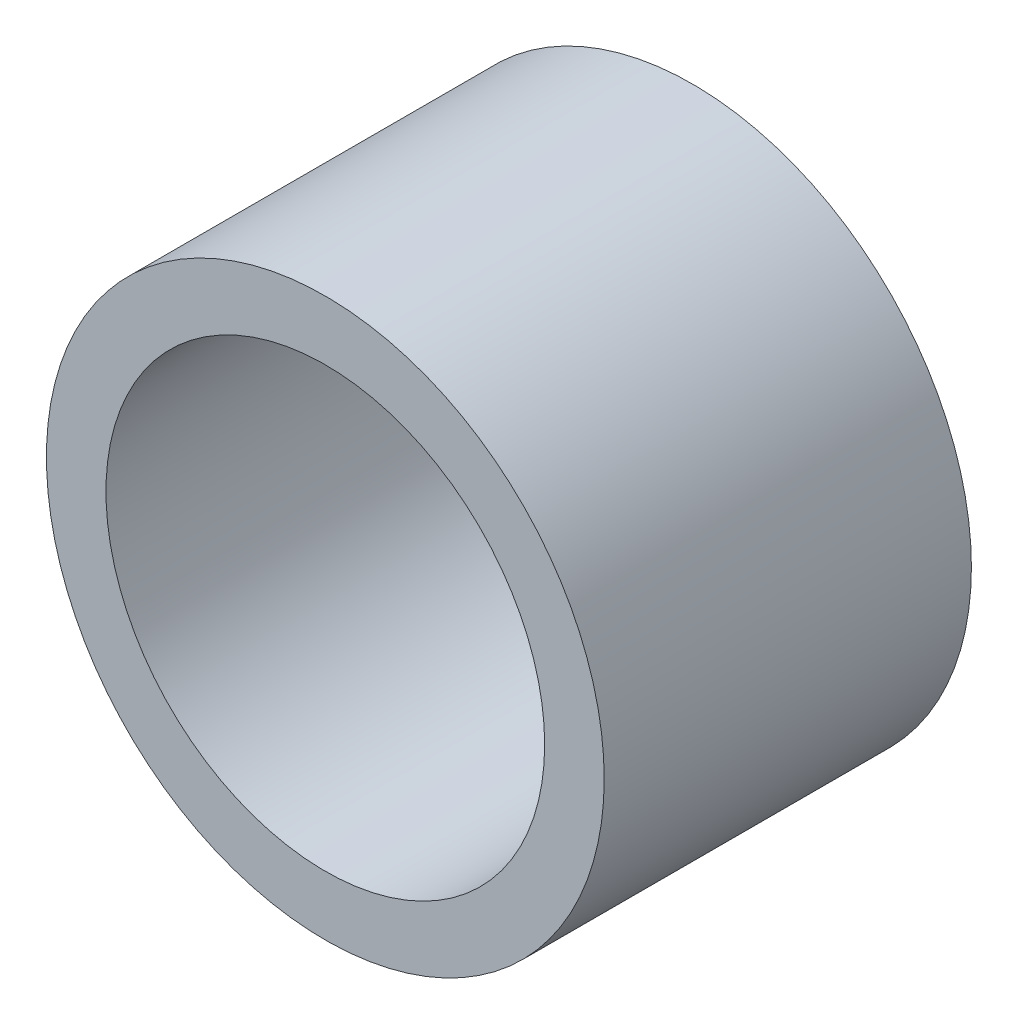
ISO-10303-21;
HEADER;
FILE_DESCRIPTION(('STEP AP214'),'2;1');
FILE_NAME('part.step','',(''),(''),'','','');
FILE_SCHEMA(('AUTOMOTIVE_DESIGN { 1 0 10303 214 1 1 1 1 }'));
ENDSEC;
DATA;
#1=APPLICATION_CONTEXT('core data for automotive mechanical design processes');
#2=APPLICATION_PROTOCOL_DEFINITION('international standard','automotive_design',2000,#1);
#3=PRODUCT_CONTEXT('',#1,'mechanical');
#4=PRODUCT('Part','Part','',(#3));
#5=PRODUCT_RELATED_PRODUCT_CATEGORY('part','',(#4));
#6=PRODUCT_DEFINITION_FORMATION('','',#4);
#7=PRODUCT_DEFINITION_CONTEXT('part definition',#1,'design');
#8=PRODUCT_DEFINITION('design','',#6,#7);
#9=PRODUCT_DEFINITION_SHAPE('','',#8);
#10=(LENGTH_UNIT() NAMED_UNIT(*) SI_UNIT(.MILLI.,.METRE.));
#11=(NAMED_UNIT(*) PLANE_ANGLE_UNIT() SI_UNIT($,.RADIAN.));
#12=(NAMED_UNIT(*) SI_UNIT($,.STERADIAN.) SOLID_ANGLE_UNIT());
#13=UNCERTAINTY_MEASURE_WITH_UNIT(LENGTH_MEASURE(1.E-05),#10,'distance_accuracy_value','');
#14=(GEOMETRIC_REPRESENTATION_CONTEXT(3) GLOBAL_UNCERTAINTY_ASSIGNED_CONTEXT((#13)) GLOBAL_UNIT_ASSIGNED_CONTEXT((#10,
#11,#12)) REPRESENTATION_CONTEXT('',''));
#15=CARTESIAN_POINT('',(0.,0.,0.));
#16=DIRECTION('',(0.,0.,1.));
#17=DIRECTION('',(1.,0.,0.));
#18=AXIS2_PLACEMENT_3D('',#15,#16,#17);
#19=CARTESIAN_POINT('',(0.,6.12293547919762,50.8));
#20=DIRECTION('',(0.,0.,1.));
#21=DIRECTION('',(1.,0.,0.));
#22=AXIS2_PLACEMENT_3D('',#19,#20,#21);
#23=PLANE('',#22);
#24=CARTESIAN_POINT('',(0.,6.12293547919762,50.8));
#25=DIRECTION('',(0.,0.,1.));
#26=DIRECTION('',(1.,0.,0.));
#27=AXIS2_PLACEMENT_3D('',#24,#25,#26);
#28=CIRCLE('',#27,38.5843712263345);
#29=CARTESIAN_POINT('',(38.5843712263345,6.12293547919762,50.8));
#30=VERTEX_POINT('',#29);
#31=EDGE_CURVE('E10',#30,#30,#28,.T.);
#32=ORIENTED_EDGE('',*,*,#31,.T.);
#33=EDGE_LOOP('',(#32));
#34=FACE_BOUND('',#33,.T.);
#35=CARTESIAN_POINT('',(0.,6.12293547919762,50.8));
#36=DIRECTION('',(0.,0.,1.));
#37=DIRECTION('',(1.,0.,0.));
#38=AXIS2_PLACEMENT_3D('',#35,#36,#37);
#39=CIRCLE('',#38,30.347159062684);
#40=CARTESIAN_POINT('',(30.347159062684,6.12293547919762,50.8));
#41=VERTEX_POINT('',#40);
#42=EDGE_CURVE('E42',#41,#41,#39,.T.);
#43=ORIENTED_EDGE('',*,*,#42,.F.);
#44=EDGE_LOOP('',(#43));
#45=FACE_BOUND('',#44,.T.);
#46=ADVANCED_FACE('F31',(#34,#45),#23,.T.);
#47=CARTESIAN_POINT('',(0.,6.12293547919762,0.));
#48=DIRECTION('',(0.,0.,1.));
#49=DIRECTION('',(1.,0.,0.));
#50=AXIS2_PLACEMENT_3D('',#47,#48,#49);
#51=PLANE('',#50);
#52=CARTESIAN_POINT('',(0.,6.12293547919762,0.));
#53=DIRECTION('',(0.,0.,1.));
#54=DIRECTION('',(1.,0.,0.));
#55=AXIS2_PLACEMENT_3D('',#52,#53,#54);
#56=CIRCLE('',#55,38.5843712263345);
#57=CARTESIAN_POINT('',(38.5843712263345,6.12293547919762,0.));
#58=VERTEX_POINT('',#57);
#59=EDGE_CURVE('E35',#58,#58,#56,.T.);
#60=ORIENTED_EDGE('',*,*,#59,.F.);
#61=EDGE_LOOP('',(#60));
#62=FACE_BOUND('',#61,.T.);
#63=CARTESIAN_POINT('',(0.,6.12293547919762,0.));
#64=DIRECTION('',(0.,0.,1.));
#65=DIRECTION('',(1.,0.,0.));
#66=AXIS2_PLACEMENT_3D('',#63,#64,#65);
#67=CIRCLE('',#66,30.347159062684);
#68=CARTESIAN_POINT('',(30.347159062684,6.12293547919762,0.));
#69=VERTEX_POINT('',#68);
#70=EDGE_CURVE('E44',#69,#69,#67,.T.);
#71=ORIENTED_EDGE('',*,*,#70,.T.);
#72=EDGE_LOOP('',(#71));
#73=FACE_BOUND('',#72,.T.);
#74=ADVANCED_FACE('F54',(#62,#73),#51,.F.);
#75=CARTESIAN_POINT('',(0.,6.12293547919762,50.8));
#76=DIRECTION('',(0.,0.,-1.));
#77=DIRECTION('',(-1.,0.,0.));
#78=AXIS2_PLACEMENT_3D('',#75,#76,#77);
#79=CYLINDRICAL_SURFACE('',#78,38.5843712263345);
#80=ORIENTED_EDGE('',*,*,#31,.F.);
#81=EDGE_LOOP('',(#80));
#82=FACE_BOUND('',#81,.T.);
#83=ORIENTED_EDGE('',*,*,#59,.T.);
#84=EDGE_LOOP('',(#83));
#85=FACE_BOUND('',#84,.T.);
#86=ADVANCED_FACE('F33',(#82,#85),#79,.T.);
#87=CARTESIAN_POINT('',(0.,6.12293547919762,50.8));
#88=DIRECTION('',(0.,0.,-1.));
#89=DIRECTION('',(-1.,0.,0.));
#90=AXIS2_PLACEMENT_3D('',#87,#88,#89);
#91=CYLINDRICAL_SURFACE('',#90,30.347159062684);
#92=ORIENTED_EDGE('',*,*,#42,.T.);
#93=EDGE_LOOP('',(#92));
#94=FACE_BOUND('',#93,.T.);
#95=ORIENTED_EDGE('',*,*,#70,.F.);
#96=EDGE_LOOP('',(#95));
#97=FACE_BOUND('',#96,.T.);
#98=ADVANCED_FACE('F50',(#94,#97),#91,.F.);
#99=CLOSED_SHELL('',(#46,#74,#86,#98));
#100=MANIFOLD_SOLID_BREP('B2',#99);
#101=ADVANCED_BREP_SHAPE_REPRESENTATION('',(#18,#100),#14);
#102=SHAPE_DEFINITION_REPRESENTATION(#9,#101);
ENDSEC;
END-ISO-10303-21;
